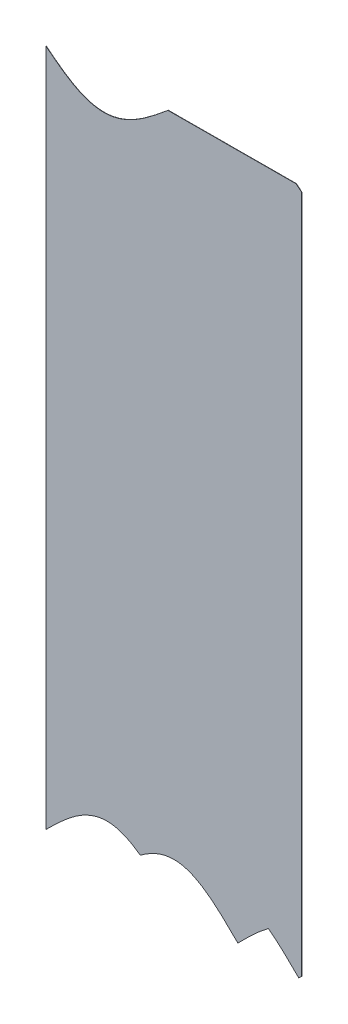
ISO-10303-21;
HEADER;
FILE_DESCRIPTION(('STEP AP214'),'2;1');
FILE_NAME('part.step','',(''),(''),'','','');
FILE_SCHEMA(('AUTOMOTIVE_DESIGN { 1 0 10303 214 1 1 1 1 }'));
ENDSEC;
DATA;
#1=APPLICATION_CONTEXT('core data for automotive mechanical design processes');
#2=APPLICATION_PROTOCOL_DEFINITION('international standard','automotive_design',2000,#1);
#3=PRODUCT_CONTEXT('',#1,'mechanical');
#4=PRODUCT('Part','Part','',(#3));
#5=PRODUCT_RELATED_PRODUCT_CATEGORY('part','',(#4));
#6=PRODUCT_DEFINITION_FORMATION('','',#4);
#7=PRODUCT_DEFINITION_CONTEXT('part definition',#1,'design');
#8=PRODUCT_DEFINITION('design','',#6,#7);
#9=PRODUCT_DEFINITION_SHAPE('','',#8);
#10=(LENGTH_UNIT() NAMED_UNIT(*) SI_UNIT(.MILLI.,.METRE.));
#11=(NAMED_UNIT(*) PLANE_ANGLE_UNIT() SI_UNIT($,.RADIAN.));
#12=(NAMED_UNIT(*) SI_UNIT($,.STERADIAN.) SOLID_ANGLE_UNIT());
#13=UNCERTAINTY_MEASURE_WITH_UNIT(LENGTH_MEASURE(1.E-05),#10,'distance_accuracy_value','');
#14=(GEOMETRIC_REPRESENTATION_CONTEXT(3) GLOBAL_UNCERTAINTY_ASSIGNED_CONTEXT((#13)) GLOBAL_UNIT_ASSIGNED_CONTEXT((#10,
#11,#12)) REPRESENTATION_CONTEXT('',''));
#15=CARTESIAN_POINT('',(0.,0.,0.));
#16=DIRECTION('',(0.,0.,1.));
#17=DIRECTION('',(1.,0.,0.));
#18=AXIS2_PLACEMENT_3D('',#15,#16,#17);
#19=CARTESIAN_POINT('',(-322.330788957895,481.431997369776,168.147839988997));
#20=DIRECTION('',(-0.757872648002997,0.652395697796506,0.00298377370707072));
#21=DIRECTION('',(-0.652398601924532,-0.75787602165982,0.));
#22=AXIS2_PLACEMENT_3D('',#19,#20,#21);
#23=PLANE('',#22);
#24=CARTESIAN_POINT('',(-322.330395257108,481.431997369776,168.247839213992));
#25=CARTESIAN_POINT('',(-322.334377498887,481.427371222006,168.247854892231));
#26=B_SPLINE_CURVE_WITH_KNOTS('',1,(#24,#25),.UNSPECIFIED.,.F.,.F.,(2,2),(0.,1.),.UNSPECIFIED.);
#27=CARTESIAN_POINT('',(-322.330395583371,481.431996990757,168.247839215277));
#28=VERTEX_POINT('',#27);
#29=CARTESIAN_POINT('',(-322.334377620597,481.427371847329,168.24785489271));
#30=VERTEX_POINT('',#29);
#31=EDGE_CURVE('E197',#28,#30,#26,.T.);
#32=ORIENTED_EDGE('',*,*,#31,.F.);
#33=DIRECTION('',(0.00393700787401531,0.,0.999992249954468));
#34=VECTOR('',#33,1.);
#35=CARTESIAN_POINT('',(-322.330789284159,481.431996990757,168.147839990281));
#36=LINE('',#35,#34);
#37=CARTESIAN_POINT('',(-322.330789284159,481.431996990757,168.147839990281));
#38=VERTEX_POINT('',#37);
#39=EDGE_CURVE('E13',#38,#28,#36,.T.);
#40=ORIENTED_EDGE('',*,*,#39,.F.);
#41=CARTESIAN_POINT('',(-322.330788957895,481.431997369776,168.147839988997));
#42=CARTESIAN_POINT('',(-322.334771199674,481.427371222006,168.147855667235));
#43=B_SPLINE_CURVE_WITH_KNOTS('',1,(#41,#42),.UNSPECIFIED.,.F.,.F.,(2,2),(0.,1.),.UNSPECIFIED.);
#44=CARTESIAN_POINT('',(-322.334771321385,481.427371847329,168.147855667715));
#45=VERTEX_POINT('',#44);
#46=EDGE_CURVE('E285',#38,#45,#43,.T.);
#47=ORIENTED_EDGE('',*,*,#46,.T.);
#48=DIRECTION('',(0.00393700787401531,0.,0.999992249954468));
#49=VECTOR('',#48,1.);
#50=CARTESIAN_POINT('',(-322.334771321385,481.427371847329,168.147855667715));
#51=LINE('',#50,#49);
#52=EDGE_CURVE('E132',#45,#30,#51,.T.);
#53=ORIENTED_EDGE('',*,*,#52,.T.);
#54=EDGE_LOOP('',(#32,#40,#47,#53));
#55=FACE_BOUND('',#54,.T.);
#56=ADVANCED_FACE('F64',(#55),#23,.T.);
#57=CARTESIAN_POINT('',(-320.56832134094,479.98219318182,168.140901086334));
#58=CARTESIAN_POINT('',(-320.960198959357,480.302507821558,168.142443923561));
#59=CARTESIAN_POINT('',(-321.890590486305,481.068483708455,168.146106910717));
#60=CARTESIAN_POINT('',(-322.330788957895,481.431997369776,168.147839988997));
#61=B_SPLINE_CURVE_WITH_KNOTS('',2,(#57,#58,#59,#60),.UNSPECIFIED.,.F.,.F.,(3,1,3),(0.,0.5,1.),.UNSPECIFIED.);
#62=DIRECTION('',(0.00393700787401531,0.,0.999992249954468));
#63=VECTOR('',#62,1.);
#64=SURFACE_OF_LINEAR_EXTRUSION('',#61,#63);
#65=CARTESIAN_POINT('',(-320.567927640152,479.98219318182,168.24090031133));
#66=CARTESIAN_POINT('',(-320.95980525857,480.302507821558,168.242443148556));
#67=CARTESIAN_POINT('',(-321.890196785517,481.068483708455,168.246106135712));
#68=CARTESIAN_POINT('',(-322.330395257108,481.431997369776,168.247839213992));
#69=B_SPLINE_CURVE_WITH_KNOTS('',2,(#65,#66,#67,#68),.UNSPECIFIED.,.F.,.F.,(3,1,3),(0.,0.5,1.),.UNSPECIFIED.);
#70=CARTESIAN_POINT('',(-320.567927640152,479.98219318182,168.24090031133));
#71=VERTEX_POINT('',#70);
#72=EDGE_CURVE('E205',#71,#28,#69,.T.);
#73=ORIENTED_EDGE('',*,*,#72,.F.);
#74=DIRECTION('',(0.00393700787401531,0.,0.999992249954468));
#75=VECTOR('',#74,1.);
#76=CARTESIAN_POINT('',(-320.56832134094,479.98219318182,168.140901086334));
#77=LINE('',#76,#75);
#78=CARTESIAN_POINT('',(-320.56832134094,479.98219318182,168.140901086334));
#79=VERTEX_POINT('',#78);
#80=EDGE_CURVE('E72',#79,#71,#77,.T.);
#81=ORIENTED_EDGE('',*,*,#80,.F.);
#82=EDGE_CURVE('E369',#79,#38,#61,.T.);
#83=ORIENTED_EDGE('',*,*,#82,.T.);
#84=ORIENTED_EDGE('',*,*,#39,.T.);
#85=EDGE_LOOP('',(#73,#81,#83,#84));
#86=FACE_BOUND('',#85,.T.);
#87=ADVANCED_FACE('F322',(#86),#64,.T.);
#88=CARTESIAN_POINT('',(-320.56832134094,268.328764497974,168.140901086334));
#89=DIRECTION('',(0.999992249954468,0.,-0.00393700787401531));
#90=DIRECTION('',(-0.00393700787401531,0.,-0.999992249954468));
#91=AXIS2_PLACEMENT_3D('',#88,#89,#90);
#92=PLANE('',#91);
#93=DIRECTION('',(0.,1.,0.));
#94=VECTOR('',#93,1.);
#95=CARTESIAN_POINT('',(-320.567927640152,268.328764497974,168.24090031133));
#96=LINE('',#95,#94);
#97=CARTESIAN_POINT('',(-320.567927640152,268.328764497975,168.24090031133));
#98=VERTEX_POINT('',#97);
#99=EDGE_CURVE('E213',#98,#71,#96,.T.);
#100=ORIENTED_EDGE('',*,*,#99,.F.);
#101=DIRECTION('',(0.00393700787401531,0.,0.999992249954468));
#102=VECTOR('',#101,1.);
#103=CARTESIAN_POINT('',(-320.56832134094,268.328764497975,168.140901086334));
#104=LINE('',#103,#102);
#105=CARTESIAN_POINT('',(-320.56832134094,268.328764497975,168.140901086334));
#106=VERTEX_POINT('',#105);
#107=EDGE_CURVE('E311',#106,#98,#104,.T.);
#108=ORIENTED_EDGE('',*,*,#107,.F.);
#109=DIRECTION('',(0.,1.,0.));
#110=VECTOR('',#109,1.);
#111=CARTESIAN_POINT('',(-320.56832134094,268.328764497974,168.140901086334));
#112=LINE('',#111,#110);
#113=EDGE_CURVE('E318',#106,#79,#112,.T.);
#114=ORIENTED_EDGE('',*,*,#113,.T.);
#115=ORIENTED_EDGE('',*,*,#80,.T.);
#116=EDGE_LOOP('',(#100,#108,#114,#115));
#117=FACE_BOUND('',#116,.T.);
#118=ADVANCED_FACE('F316',(#117),#92,.T.);
#119=CARTESIAN_POINT('',(-320.56832134094,268.328764497975,168.140901086334));
#120=CARTESIAN_POINT('',(-320.757077697651,268.139733582945,168.141644227356));
#121=CARTESIAN_POINT('',(-321.002892084208,267.893118426474,168.142612008032));
#122=CARTESIAN_POINT('',(-321.022755719495,267.873188574578,168.142690211927));
#123=CARTESIAN_POINT('',(-321.179185315276,267.716228172024,168.14330608125));
#124=CARTESIAN_POINT('',(-321.462292284474,267.432000000001,168.144420684255));
#125=B_SPLINE_CURVE_WITH_KNOTS('',2,(#119,#120,#121,#122,#123,#124),.UNSPECIFIED.,.F.,.F.,(3,1,
1,1,3),(0.,0.475,0.5,0.525,1.),.UNSPECIFIED.);
#126=DIRECTION('',(0.00393700787401531,0.,0.999992249954468));
#127=VECTOR('',#126,1.);
#128=SURFACE_OF_LINEAR_EXTRUSION('',#125,#127);
#129=CARTESIAN_POINT('',(-320.567927640152,268.328764497975,168.24090031133));
#130=CARTESIAN_POINT('',(-320.756683996863,268.139733582945,168.241643452352));
#131=CARTESIAN_POINT('',(-321.002498383421,267.893118426474,168.242611233028));
#132=CARTESIAN_POINT('',(-321.022362018708,267.873188574578,168.242689436922));
#133=CARTESIAN_POINT('',(-321.178791614489,267.716228172024,168.243305306245));
#134=CARTESIAN_POINT('',(-321.461898583686,267.432000000001,168.244419909251));
#135=B_SPLINE_CURVE_WITH_KNOTS('',2,(#129,#130,#131,#132,#133,#134),.UNSPECIFIED.,.F.,.F.,(3,1,
1,1,3),(0.,0.475,0.5,0.525,1.),.UNSPECIFIED.);
#136=CARTESIAN_POINT('',(-321.461898230831,267.432000354254,168.244419907861));
#137=VERTEX_POINT('',#136);
#138=EDGE_CURVE('E219',#98,#137,#135,.T.);
#139=ORIENTED_EDGE('',*,*,#138,.T.);
#140=DIRECTION('',(0.00393700787401531,0.,0.999992249954468));
#141=VECTOR('',#140,1.);
#142=CARTESIAN_POINT('',(-321.462291931618,267.432000354254,168.144420682866));
#143=LINE('',#142,#141);
#144=CARTESIAN_POINT('',(-321.462291931618,267.432000354254,168.144420682866));
#145=VERTEX_POINT('',#144);
#146=EDGE_CURVE('E308',#145,#137,#143,.T.);
#147=ORIENTED_EDGE('',*,*,#146,.F.);
#148=EDGE_CURVE('E339',#106,#145,#125,.T.);
#149=ORIENTED_EDGE('',*,*,#148,.F.);
#150=ORIENTED_EDGE('',*,*,#107,.T.);
#151=EDGE_LOOP('',(#139,#147,#149,#150));
#152=FACE_BOUND('',#151,.T.);
#153=ADVANCED_FACE('F330',(#152),#128,.F.);
#154=CARTESIAN_POINT('',(-321.462292284474,267.432000000001,168.144420684255));
#155=CARTESIAN_POINT('',(-321.856559645749,267.827828797905,168.145972929991));
#156=CARTESIAN_POINT('',(-322.053749962608,268.025583728596,168.146749275838));
#157=CARTESIAN_POINT('',(-322.382250878624,268.355025239281,168.148042596554));
#158=CARTESIAN_POINT('',(-322.960527736483,268.933055903792,168.150319294741));
#159=CARTESIAN_POINT('',(-323.546316052846,269.515388330365,168.152625565829));
#160=CARTESIAN_POINT('',(-324.134607955361,270.095711116484,168.154941693632));
#161=CARTESIAN_POINT('',(-324.72403774647,270.67137834553,168.157262301345));
#162=CARTESIAN_POINT('',(-325.314080163924,271.240600306046,168.159585320992));
#163=CARTESIAN_POINT('',(-325.904490023213,271.801883833022,168.161909787272));
#164=CARTESIAN_POINT('',(-326.805976568551,272.644362399339,168.165458974406));
#165=CARTESIAN_POINT('',(-327.98460798061,273.700660867898,168.170099291518));
#166=CARTESIAN_POINT('',(-329.164459067439,274.703581992053,168.174744410537));
#167=CARTESIAN_POINT('',(-330.345019926099,275.643834369482,168.179392323955));
#168=CARTESIAN_POINT('',(-330.925615134616,276.071090350348,168.181678149578));
#169=B_SPLINE_CURVE_WITH_KNOTS('',2,(#154,#155,#156,#157,#158,#159,#160,#161,#162,#163,#164,
#165,#166,#167,#168),.UNSPECIFIED.,.F.,.F.,(3,2,1,1,1,1,1,1,1,1,1,1,3),(0.,0.0625,0.125,0.1875,
0.25,0.3125,0.375,0.4375,0.5,0.625,0.75,0.875,1.),.UNSPECIFIED.);
#170=DIRECTION('',(0.00393700787401531,0.,0.999992249954468));
#171=VECTOR('',#170,1.);
#172=SURFACE_OF_LINEAR_EXTRUSION('',#169,#171);
#173=CARTESIAN_POINT('',(-321.461898583686,267.432000000001,168.244419909251));
#174=CARTESIAN_POINT('',(-321.856165944962,267.827828797905,168.245972154986));
#175=CARTESIAN_POINT('',(-322.053356261821,268.025583728596,168.246748500833));
#176=CARTESIAN_POINT('',(-322.381857177836,268.355025239281,168.24804182155));
#177=CARTESIAN_POINT('',(-322.960134035696,268.933055903792,168.250318519737));
#178=CARTESIAN_POINT('',(-323.545922352059,269.515388330365,168.252624790825));
#179=CARTESIAN_POINT('',(-324.134214254573,270.095711116484,168.254940918627));
#180=CARTESIAN_POINT('',(-324.723644045682,270.67137834553,168.257261526341));
#181=CARTESIAN_POINT('',(-325.313686463137,271.240600306046,168.259584545988));
#182=CARTESIAN_POINT('',(-325.904096322425,271.801883833022,168.261909012267));
#183=CARTESIAN_POINT('',(-326.805582867764,272.644362399339,168.265458199401));
#184=CARTESIAN_POINT('',(-327.984214279823,273.700660867898,168.270098516513));
#185=CARTESIAN_POINT('',(-329.164065366652,274.703581992053,168.274743635532));
#186=CARTESIAN_POINT('',(-330.344626225312,275.643834369482,168.27939154895));
#187=CARTESIAN_POINT('',(-330.925221433828,276.071090350348,168.281677374573));
#188=B_SPLINE_CURVE_WITH_KNOTS('',2,(#173,#174,#175,#176,#177,#178,#179,#180,#181,#182,#183,
#184,#185,#186,#187),.UNSPECIFIED.,.F.,.F.,(3,2,1,1,1,1,1,1,1,1,1,1,3),(0.,0.0625,0.125,0.1875,
0.25,0.3125,0.375,0.4375,0.5,0.625,0.75,0.875,1.),.UNSPECIFIED.);
#189=CARTESIAN_POINT('',(-330.925221012033,276.071090039952,168.281677372912));
#190=VERTEX_POINT('',#189);
#191=EDGE_CURVE('E223',#137,#190,#188,.T.);
#192=ORIENTED_EDGE('',*,*,#191,.T.);
#193=DIRECTION('',(0.00393700787401531,0.,0.999992249954468));
#194=VECTOR('',#193,1.);
#195=CARTESIAN_POINT('',(-330.925614712821,276.071090039952,168.181678147917));
#196=LINE('',#195,#194);
#197=CARTESIAN_POINT('',(-330.925614712821,276.071090039952,168.181678147917));
#198=VERTEX_POINT('',#197);
#199=EDGE_CURVE('E305',#198,#190,#196,.T.);
#200=ORIENTED_EDGE('',*,*,#199,.F.);
#201=EDGE_CURVE('E336',#145,#198,#169,.T.);
#202=ORIENTED_EDGE('',*,*,#201,.F.);
#203=ORIENTED_EDGE('',*,*,#146,.T.);
#204=EDGE_LOOP('',(#192,#200,#202,#203));
#205=FACE_BOUND('',#204,.T.);
#206=ADVANCED_FACE('F334',(#205),#172,.F.);
#207=CARTESIAN_POINT('',(-330.925615134616,276.071090350348,168.181678149578));
#208=CARTESIAN_POINT('',(-331.506176417281,275.643859335281,168.183963841633));
#209=CARTESIAN_POINT('',(-332.686700785038,274.703640046976,168.188611611385));
#210=CARTESIAN_POINT('',(-333.866551930113,273.700722389315,168.193256730633));
#211=CARTESIAN_POINT('',(-335.045183436303,272.644426811852,168.197897048116));
#212=CARTESIAN_POINT('',(-335.946669796317,271.801950263575,168.20144623452));
#213=CARTESIAN_POINT('',(-336.537079697635,271.240667759343,168.203770700965));
#214=CARTESIAN_POINT('',(-337.127122179268,270.671446651715,168.206093720865));
#215=CARTESIAN_POINT('',(-337.716552064583,270.095780094944,168.208414328949));
#216=CARTESIAN_POINT('',(-338.304844141954,269.515457748929,168.21073045744));
#217=CARTESIAN_POINT('',(-338.890632893447,268.933125348367,168.213036730241));
#218=CARTESIAN_POINT('',(-339.468911403546,268.355093334999,168.215313434933));
#219=CARTESIAN_POINT('',(-339.797480306624,268.025583728596,168.216607023317));
#220=CARTESIAN_POINT('',(-339.994623638438,267.827875969089,168.217383184182));
#221=CARTESIAN_POINT('',(-340.388937984758,267.432000000001,168.2189356149));
#222=B_SPLINE_CURVE_WITH_KNOTS('',2,(#207,#208,#209,#210,#211,#212,#213,#214,#215,#216,#217,
#218,#219,#220,#221),.UNSPECIFIED.,.F.,.F.,(3,1,1,1,1,1,1,1,1,1,1,2,3),(0.,0.125,0.25,0.375,0.5,
0.5625,0.625,0.6875,0.75,0.8125,0.875,0.9375,1.),.UNSPECIFIED.);
#223=DIRECTION('',(0.00393700787401531,0.,0.999992249954468));
#224=VECTOR('',#223,1.);
#225=SURFACE_OF_LINEAR_EXTRUSION('',#222,#224);
#226=CARTESIAN_POINT('',(-330.925221433828,276.071090350348,168.281677374573));
#227=CARTESIAN_POINT('',(-331.505782716493,275.643859335281,168.283963066628));
#228=CARTESIAN_POINT('',(-332.68630708425,274.703640046976,168.28861083638));
#229=CARTESIAN_POINT('',(-333.866158229326,273.700722389315,168.293255955628));
#230=CARTESIAN_POINT('',(-335.044789735516,272.644426811852,168.297896273112));
#231=CARTESIAN_POINT('',(-335.946276095529,271.801950263575,168.301445459516));
#232=CARTESIAN_POINT('',(-336.536685996848,271.240667759343,168.303769925961));
#233=CARTESIAN_POINT('',(-337.12672847848,270.671446651715,168.30609294586));
#234=CARTESIAN_POINT('',(-337.716158363795,270.095780094944,168.308413553945));
#235=CARTESIAN_POINT('',(-338.304450441167,269.515457748929,168.310729682436));
#236=CARTESIAN_POINT('',(-338.89023919266,268.933125348367,168.313035955237));
#237=CARTESIAN_POINT('',(-339.468517702759,268.355093334999,168.315312659929));
#238=CARTESIAN_POINT('',(-339.797086605837,268.025583728596,168.316606248313));
#239=CARTESIAN_POINT('',(-339.994229937651,267.827875969089,168.317382409178));
#240=CARTESIAN_POINT('',(-340.38854428397,267.432000000001,168.318934839895));
#241=B_SPLINE_CURVE_WITH_KNOTS('',2,(#226,#227,#228,#229,#230,#231,#232,#233,#234,#235,#236,
#237,#238,#239,#240),.UNSPECIFIED.,.F.,.F.,(3,1,1,1,1,1,1,1,1,1,1,2,3),(0.,0.125,0.25,0.375,0.5,
0.5625,0.625,0.6875,0.75,0.8125,0.875,0.9375,1.),.UNSPECIFIED.);
#242=CARTESIAN_POINT('',(-340.388543931114,267.432000354254,168.318934838506));
#243=VERTEX_POINT('',#242);
#244=EDGE_CURVE('E230',#190,#243,#241,.T.);
#245=ORIENTED_EDGE('',*,*,#244,.T.);
#246=DIRECTION('',(0.00393700787401531,0.,0.999992249954468));
#247=VECTOR('',#246,1.);
#248=CARTESIAN_POINT('',(-340.388937631902,267.432000354254,168.218935613511));
#249=LINE('',#248,#247);
#250=CARTESIAN_POINT('',(-340.388937631902,267.432000354254,168.218935613511));
#251=VERTEX_POINT('',#250);
#252=EDGE_CURVE('E302',#251,#243,#249,.T.);
#253=ORIENTED_EDGE('',*,*,#252,.F.);
#254=EDGE_CURVE('E338',#198,#251,#222,.T.);
#255=ORIENTED_EDGE('',*,*,#254,.F.);
#256=ORIENTED_EDGE('',*,*,#199,.T.);
#257=EDGE_LOOP('',(#245,#253,#255,#256));
#258=FACE_BOUND('',#257,.T.);
#259=ADVANCED_FACE('F362',(#258),#225,.F.);
#260=CARTESIAN_POINT('',(-340.388937984758,267.432000000001,168.2189356149));
#261=CARTESIAN_POINT('',(-340.704297832972,267.748608783548,168.220177198728));
#262=CARTESIAN_POINT('',(-340.862024175728,267.906849069204,168.220798173394));
#263=CARTESIAN_POINT('',(-341.124788873571,268.170469971843,168.221832688096));
#264=CARTESIAN_POINT('',(-341.587342588013,268.633557245671,168.223653779825));
#265=CARTESIAN_POINT('',(-342.055904403843,269.101017228589,168.225498525681));
#266=CARTESIAN_POINT('',(-342.78550764524,269.825329577419,168.228371001649));
#267=CARTESIAN_POINT('',(-343.722519235765,270.74246865894,168.232060052249));
#268=CARTESIAN_POINT('',(-344.6635351191,271.645243159154,168.235764867904));
#269=CARTESIAN_POINT('',(-345.606370128187,272.526385528975,168.239476845526));
#270=CARTESIAN_POINT('',(-346.550183558413,273.380108286688,168.243192675231));
#271=CARTESIAN_POINT('',(-347.494582875178,274.201232462322,168.246910811593));
#272=CARTESIAN_POINT('',(-348.439360058703,274.984949854647,168.250630435631));
#273=CARTESIAN_POINT('',(-349.384394484902,275.726751330112,168.254351072443));
#274=CARTESIAN_POINT('',(-350.329611226209,276.422409555424,168.258072427037));
#275=CARTESIAN_POINT('',(-351.274961206061,277.067982323384,168.261794306196));
#276=CARTESIAN_POINT('',(-352.220410846477,277.659823943802,168.265516577722));
#277=CARTESIAN_POINT('',(-353.165936239217,278.19459965208,168.269239147489));
#278=CARTESIAN_POINT('',(-354.111519825465,278.669300800495,168.272961946365));
#279=CARTESIAN_POINT('',(-355.057148283643,279.081259515709,168.276684921904));
#280=CARTESIAN_POINT('',(-356.002811185809,279.428162251105,168.28040803305));
#281=CARTESIAN_POINT('',(-356.948500128554,279.708061844443,168.284131246719));
#282=CARTESIAN_POINT('',(-357.894208104061,279.919387809357,168.287854535321));
#283=CARTESIAN_POINT('',(-358.839929067906,280.060954732553,168.291577875059));
#284=CARTESIAN_POINT('',(-359.785657599605,280.131968642999,168.295301244591));
#285=CARTESIAN_POINT('',(-360.731388615642,280.132031301646,168.299024623904));
#286=CARTESIAN_POINT('',(-361.677117153637,280.061142357328,168.302747993461));
#287=CARTESIAN_POINT('',(-362.622838139388,279.919699347624,168.306471333285));
#288=CARTESIAN_POINT('',(-363.568546147946,279.708495547372,168.310194622016));
#289=CARTESIAN_POINT('',(-364.514235132811,279.428715686129,168.313917835851));
#290=CARTESIAN_POINT('',(-365.459898083884,279.081929578747,168.31764094719));
#291=CARTESIAN_POINT('',(-366.405526610589,278.670083729619,168.321363922999));
#292=CARTESIAN_POINT('',(-367.351110294364,278.195491043832,168.325086722259));
#293=CARTESIAN_POINT('',(-368.296635798562,277.660818792983,168.328809292465));
#294=CARTESIAN_POINT('',(-369.242085582141,277.069075032847,168.332531564555));
#295=CARTESIAN_POINT('',(-370.187418584275,276.423605687197,168.336253376872));
#296=CARTESIAN_POINT('',(-370.666454206828,276.071090350347,168.338139358506));
#297=B_SPLINE_CURVE_WITH_KNOTS('',2,(#260,#261,#262,#263,#264,#265,#266,#267,#268,#269,#270,
#271,#272,#273,#274,#275,#276,#277,#278,#279,#280,#281,#282,#283,#284,#285,#286,#287,#288,#289,
#290,#291,#292,#293,#294,#295,#296),.UNSPECIFIED.,.F.,.F.,(3,2,1,1,1,1,1,1,1,1,1,1,1,1,1,1,1,1,
1,1,1,1,1,1,1,1,1,1,1,1,1,1,1,1,3),(0.,0.015625,0.03125,0.046875,0.0625,0.09375,0.125,0.15625,
0.1875,0.21875,0.25,0.28125,0.3125,0.34375,0.375,0.40625,0.4375,0.46875,0.5,0.53125,0.5625,
0.59375,0.625,0.65625,0.6875,0.71875,0.75,0.78125,0.8125,0.84375,0.875,0.90625,0.9375,0.96875,
1.),.UNSPECIFIED.);
#298=DIRECTION('',(0.00393700787401531,0.,0.999992249954468));
#299=VECTOR('',#298,1.);
#300=SURFACE_OF_LINEAR_EXTRUSION('',#297,#299);
#301=CARTESIAN_POINT('',(-340.38854428397,267.432000000001,168.318934839895));
#302=CARTESIAN_POINT('',(-340.703904132185,267.748608783548,168.320176423723));
#303=CARTESIAN_POINT('',(-340.86163047494,267.906849069204,168.320797398389));
#304=CARTESIAN_POINT('',(-341.124395172783,268.170469971843,168.321831913091));
#305=CARTESIAN_POINT('',(-341.586948887226,268.633557245671,168.323653004821));
#306=CARTESIAN_POINT('',(-342.055510703056,269.101017228589,168.325497750676));
#307=CARTESIAN_POINT('',(-342.785113944452,269.825329577419,168.328370226644));
#308=CARTESIAN_POINT('',(-343.722125534978,270.74246865894,168.332059277244));
#309=CARTESIAN_POINT('',(-344.663141418312,271.645243159154,168.335764092899));
#310=CARTESIAN_POINT('',(-345.6059764274,272.526385528975,168.339476070522));
#311=CARTESIAN_POINT('',(-346.549789857626,273.380108286688,168.343191900226));
#312=CARTESIAN_POINT('',(-347.49418917439,274.201232462322,168.346910036588));
#313=CARTESIAN_POINT('',(-348.438966357916,274.984949854647,168.350629660626));
#314=CARTESIAN_POINT('',(-349.384000784114,275.726751330112,168.354350297438));
#315=CARTESIAN_POINT('',(-350.329217525422,276.422409555424,168.358071652032));
#316=CARTESIAN_POINT('',(-351.274567505274,277.067982323384,168.361793531191));
#317=CARTESIAN_POINT('',(-352.220017145689,277.659823943802,168.365515802718));
#318=CARTESIAN_POINT('',(-353.16554253843,278.19459965208,168.369238372484));
#319=CARTESIAN_POINT('',(-354.111126124678,278.669300800495,168.372961171361));
#320=CARTESIAN_POINT('',(-355.056754582855,279.081259515709,168.3766841469));
#321=CARTESIAN_POINT('',(-356.002417485021,279.428162251105,168.380407258046));
#322=CARTESIAN_POINT('',(-356.948106427767,279.708061844443,168.384130471715));
#323=CARTESIAN_POINT('',(-357.893814403273,279.919387809357,168.387853760317));
#324=CARTESIAN_POINT('',(-358.839535367119,280.060954732553,168.391577100054));
#325=CARTESIAN_POINT('',(-359.785263898818,280.131968642999,168.395300469586));
#326=CARTESIAN_POINT('',(-360.730994914854,280.132031301646,168.399023848899));
#327=CARTESIAN_POINT('',(-361.67672345285,280.061142357328,168.402747218456));
#328=CARTESIAN_POINT('',(-362.622444438601,279.919699347624,168.40647055828));
#329=CARTESIAN_POINT('',(-363.568152447158,279.708495547372,168.410193847012));
#330=CARTESIAN_POINT('',(-364.513841432023,279.428715686129,168.413917060847));
#331=CARTESIAN_POINT('',(-365.459504383097,279.081929578747,168.417640172186));
#332=CARTESIAN_POINT('',(-366.405132909801,278.670083729619,168.421363147994));
#333=CARTESIAN_POINT('',(-367.350716593576,278.195491043832,168.425085947255));
#334=CARTESIAN_POINT('',(-368.296242097775,277.660818792983,168.42880851746));
#335=CARTESIAN_POINT('',(-369.241691881353,277.069075032847,168.43253078955));
#336=CARTESIAN_POINT('',(-370.187024883487,276.423605687197,168.436252601867));
#337=CARTESIAN_POINT('',(-370.66606050604,276.071090350347,168.438138583502));
#338=B_SPLINE_CURVE_WITH_KNOTS('',2,(#301,#302,#303,#304,#305,#306,#307,#308,#309,#310,#311,
#312,#313,#314,#315,#316,#317,#318,#319,#320,#321,#322,#323,#324,#325,#326,#327,#328,#329,#330,
#331,#332,#333,#334,#335,#336,#337),.UNSPECIFIED.,.F.,.F.,(3,2,1,1,1,1,1,1,1,1,1,1,1,1,1,1,1,1,
1,1,1,1,1,1,1,1,1,1,1,1,1,1,1,1,3),(0.,0.015625,0.03125,0.046875,0.0625,0.09375,0.125,0.15625,
0.1875,0.21875,0.25,0.28125,0.3125,0.34375,0.375,0.40625,0.4375,0.46875,0.5,0.53125,0.5625,
0.59375,0.625,0.65625,0.6875,0.71875,0.75,0.78125,0.8125,0.84375,0.875,0.90625,0.9375,0.96875,
1.),.UNSPECIFIED.);
#339=CARTESIAN_POINT('',(-370.666060084242,276.071090660742,168.438138581841));
#340=VERTEX_POINT('',#339);
#341=EDGE_CURVE('E237',#243,#340,#338,.T.);
#342=ORIENTED_EDGE('',*,*,#341,.T.);
#343=DIRECTION('',(0.00393700787401531,0.,0.999992249954468));
#344=VECTOR('',#343,1.);
#345=CARTESIAN_POINT('',(-370.66645378503,276.071090660742,168.338139356846));
#346=LINE('',#345,#344);
#347=CARTESIAN_POINT('',(-370.66645378503,276.071090660742,168.338139356846));
#348=VERTEX_POINT('',#347);
#349=EDGE_CURVE('E299',#348,#340,#346,.T.);
#350=ORIENTED_EDGE('',*,*,#349,.F.);
#351=EDGE_CURVE('E341',#251,#348,#297,.T.);
#352=ORIENTED_EDGE('',*,*,#351,.F.);
#353=ORIENTED_EDGE('',*,*,#252,.T.);
#354=EDGE_LOOP('',(#342,#350,#352,#353));
#355=FACE_BOUND('',#354,.T.);
#356=ADVANCED_FACE('F406',(#355),#300,.F.);
#357=CARTESIAN_POINT('',(-370.666454206828,276.071090350347,168.338139358506));
#358=CARTESIAN_POINT('',(-371.129561941891,276.411884586804,168.339962631436));
#359=CARTESIAN_POINT('',(-372.043886232976,277.037834969649,168.343562361268));
#360=CARTESIAN_POINT('',(-372.958350462174,277.613706279491,168.347162642041));
#361=CARTESIAN_POINT('',(-373.872882391955,278.136428954093,168.350763189354));
#362=CARTESIAN_POINT('',(-374.787466749569,278.603252691807,168.354363943077));
#363=CARTESIAN_POINT('',(-375.702091883396,279.011723721842,168.357964857338));
#364=CARTESIAN_POINT('',(-376.616748632295,279.359696494126,168.361565896069));
#365=CARTESIAN_POINT('',(-377.53142959201,279.645344160638,168.365167030118));
#366=CARTESIAN_POINT('',(-378.446128610359,279.867167631212,168.368768235265));
#367=CARTESIAN_POINT('',(-379.360840398394,280.024003068538,168.372369490687));
#368=CARTESIAN_POINT('',(-380.275560231323,280.115027749804,168.375970777782));
#369=CARTESIAN_POINT('',(-381.190283737134,280.139764233728,168.379572079337));
#370=CARTESIAN_POINT('',(-382.105006713335,280.098082779337,168.383173378807));
#371=CARTESIAN_POINT('',(-383.019724918322,279.990202003792,168.386774659493));
#372=CARTESIAN_POINT('',(-383.934433915215,279.816687775604,168.390375903926));
#373=CARTESIAN_POINT('',(-384.849128862997,279.578450341895,168.393977093047));
#374=CARTESIAN_POINT('',(-385.763804266927,279.276739735541,168.397578205223));
#375=CARTESIAN_POINT('',(-386.6784537017,278.913139476503,168.401179215158));
#376=CARTESIAN_POINT('',(-387.59306938089,278.489558670829,168.404780092196));
#377=CARTESIAN_POINT('',(-388.507641589202,278.00822258343,168.408380798087));
#378=CARTESIAN_POINT('',(-389.42215787115,277.471661825519,168.411981283794));
#379=CARTESIAN_POINT('',(-390.336601780019,276.882700393442,168.415581484565));
#380=CARTESIAN_POINT('',(-391.250950945471,276.244442892535,168.419181312328));
#381=CARTESIAN_POINT('',(-392.165173923965,275.560261543025,168.422780643288));
#382=CARTESIAN_POINT('',(-393.079224945869,274.833783971913,168.426379297248));
#383=CARTESIAN_POINT('',(-393.993034376951,274.068884008509,168.429977000056));
#384=CARTESIAN_POINT('',(-394.90649051121,273.269680036549,168.433573311921));
#385=CARTESIAN_POINT('',(-395.819402011464,272.440551718686,168.43716747954));
#386=CARTESIAN_POINT('',(-396.73141097789,271.586205287922,168.44075809385));
#387=CARTESIAN_POINT('',(-397.641760579793,270.71188392867,168.444342175177));
#388=CARTESIAN_POINT('',(-398.548523742505,269.824118179228,168.447912136556));
#389=CARTESIAN_POINT('',(-399.253691623123,269.124201585034,168.450688409571));
#390=CARTESIAN_POINT('',(-399.707348986316,268.671741241076,168.452474476024));
#391=CARTESIAN_POINT('',(-399.950393700787,268.428486315291,168.453431352394));
#392=B_SPLINE_CURVE_WITH_KNOTS('',2,(#357,#358,#359,#360,#361,#362,#363,#364,#365,#366,#367,
#368,#369,#370,#371,#372,#373,#374,#375,#376,#377,#378,#379,#380,#381,#382,#383,#384,#385,#386,
#387,#388,#389,#390,#391),.UNSPECIFIED.,.F.,.F.,(3,1,1,1,1,1,1,1,1,1,1,1,1,1,1,1,1,1,1,1,1,1,1,
1,1,1,1,1,1,1,1,1,1,3),(0.,0.03125,0.0625,0.09375,0.125,0.15625,0.1875,0.21875,0.25,0.28125,
0.3125,0.34375,0.375,0.40625,0.4375,0.46875,0.5,0.53125,0.5625,0.59375,0.625,0.65625,0.6875,
0.71875,0.75,0.78125,0.8125,0.84375,0.875,0.90625,0.9375,0.96875,0.984375,1.),.UNSPECIFIED.);
#393=DIRECTION('',(0.00393700787401531,0.,0.999992249954468));
#394=VECTOR('',#393,1.);
#395=SURFACE_OF_LINEAR_EXTRUSION('',#392,#394);
#396=CARTESIAN_POINT('',(-370.66606050604,276.071090350347,168.438138583502));
#397=CARTESIAN_POINT('',(-371.129168241104,276.411884586804,168.439961856432));
#398=CARTESIAN_POINT('',(-372.043492532189,277.037834969649,168.443561586263));
#399=CARTESIAN_POINT('',(-372.957956761386,277.613706279491,168.447161867036));
#400=CARTESIAN_POINT('',(-373.872488691168,278.136428954093,168.450762414349));
#401=CARTESIAN_POINT('',(-374.787073048782,278.603252691807,168.454363168073));
#402=CARTESIAN_POINT('',(-375.701698182608,279.011723721842,168.457964082334));
#403=CARTESIAN_POINT('',(-376.616354931508,279.359696494126,168.461565121064));
#404=CARTESIAN_POINT('',(-377.531035891222,279.645344160638,168.465166255114));
#405=CARTESIAN_POINT('',(-378.445734909572,279.867167631212,168.468767460261));
#406=CARTESIAN_POINT('',(-379.360446697607,280.024003068538,168.472368715683));
#407=CARTESIAN_POINT('',(-380.275166530535,280.115027749804,168.475970002778));
#408=CARTESIAN_POINT('',(-381.189890036347,280.139764233728,168.479571304333));
#409=CARTESIAN_POINT('',(-382.104613012548,280.098082779337,168.483172603803));
#410=CARTESIAN_POINT('',(-383.019331217534,279.990202003792,168.486773884489));
#411=CARTESIAN_POINT('',(-383.934040214428,279.816687775604,168.490375128922));
#412=CARTESIAN_POINT('',(-384.84873516221,279.578450341895,168.493976318043));
#413=CARTESIAN_POINT('',(-385.76341056614,279.276739735541,168.497577430219));
#414=CARTESIAN_POINT('',(-386.678060000913,278.913139476503,168.501178440154));
#415=CARTESIAN_POINT('',(-387.592675680102,278.489558670829,168.504779317191));
#416=CARTESIAN_POINT('',(-388.507247888415,278.00822258343,168.508380023082));
#417=CARTESIAN_POINT('',(-389.421764170363,277.471661825519,168.511980508789));
#418=CARTESIAN_POINT('',(-390.336208079232,276.882700393442,168.51558070956));
#419=CARTESIAN_POINT('',(-391.250557244683,276.244442892535,168.519180537323));
#420=CARTESIAN_POINT('',(-392.164780223177,275.560261543025,168.522779868283));
#421=CARTESIAN_POINT('',(-393.078831245082,274.833783971913,168.526378522243));
#422=CARTESIAN_POINT('',(-393.992640676164,274.068884008509,168.529976225051));
#423=CARTESIAN_POINT('',(-394.906096810423,273.269680036549,168.533572536916));
#424=CARTESIAN_POINT('',(-395.819008310677,272.440551718686,168.537166704536));
#425=CARTESIAN_POINT('',(-396.731017277102,271.586205287922,168.540757318845));
#426=CARTESIAN_POINT('',(-397.641366879005,270.71188392867,168.544341400173));
#427=CARTESIAN_POINT('',(-398.548130041717,269.824118179228,168.547911361552));
#428=CARTESIAN_POINT('',(-399.253297922336,269.124201585034,168.550687634566));
#429=CARTESIAN_POINT('',(-399.706955285528,268.671741241076,168.552473701019));
#430=CARTESIAN_POINT('',(-399.95,268.428486315291,168.55343057739));
#431=B_SPLINE_CURVE_WITH_KNOTS('',2,(#396,#397,#398,#399,#400,#401,#402,#403,#404,#405,#406,
#407,#408,#409,#410,#411,#412,#413,#414,#415,#416,#417,#418,#419,#420,#421,#422,#423,#424,#425,
#426,#427,#428,#429,#430),.UNSPECIFIED.,.F.,.F.,(3,1,1,1,1,1,1,1,1,1,1,1,1,1,1,1,1,1,1,1,1,1,1,
1,1,1,1,1,1,1,1,1,1,3),(0.,0.03125,0.0625,0.09375,0.125,0.15625,0.1875,0.21875,0.25,0.28125,
0.3125,0.34375,0.375,0.40625,0.4375,0.46875,0.5,0.53125,0.5625,0.59375,0.625,0.65625,0.6875,
0.71875,0.75,0.78125,0.8125,0.84375,0.875,0.90625,0.9375,0.96875,0.984375,1.),.UNSPECIFIED.);
#432=CARTESIAN_POINT('',(-399.95,268.428486315291,168.55343057739));
#433=VERTEX_POINT('',#432);
#434=EDGE_CURVE('E244',#340,#433,#431,.T.);
#435=ORIENTED_EDGE('',*,*,#434,.T.);
#436=DIRECTION('',(0.00393700787401531,0.,0.999992249954468));
#437=VECTOR('',#436,1.);
#438=CARTESIAN_POINT('',(-399.950393700787,268.428486315291,168.453431352394));
#439=LINE('',#438,#437);
#440=CARTESIAN_POINT('',(-399.950393700787,268.428486315291,168.453431352394));
#441=VERTEX_POINT('',#440);
#442=EDGE_CURVE('E296',#441,#433,#439,.T.);
#443=ORIENTED_EDGE('',*,*,#442,.F.);
#444=EDGE_CURVE('E537',#348,#441,#392,.T.);
#445=ORIENTED_EDGE('',*,*,#444,.F.);
#446=ORIENTED_EDGE('',*,*,#349,.T.);
#447=EDGE_LOOP('',(#435,#443,#445,#446));
#448=FACE_BOUND('',#447,.T.);
#449=ADVANCED_FACE('F413',(#448),#395,.F.);
#450=CARTESIAN_POINT('',(-399.950393700787,268.42848631529,168.453431352394));
#451=DIRECTION('',(0.999992249954468,0.,-0.00393700787401531));
#452=DIRECTION('',(-0.00393700787401531,0.,-0.999992249954468));
#453=AXIS2_PLACEMENT_3D('',#450,#451,#452);
#454=PLANE('',#453);
#455=DIRECTION('',(0.,1.,0.));
#456=VECTOR('',#455,1.);
#457=CARTESIAN_POINT('',(-399.95,268.42848631529,168.55343057739));
#458=LINE('',#457,#456);
#459=CARTESIAN_POINT('',(-399.95,479.900822082311,168.55343057739));
#460=VERTEX_POINT('',#459);
#461=EDGE_CURVE('E251',#433,#460,#458,.T.);
#462=ORIENTED_EDGE('',*,*,#461,.T.);
#463=DIRECTION('',(0.00393700787401531,0.,0.999992249954468));
#464=VECTOR('',#463,1.);
#465=CARTESIAN_POINT('',(-399.950393700787,479.900822082311,168.453431352394));
#466=LINE('',#465,#464);
#467=CARTESIAN_POINT('',(-399.950393700787,479.900822082311,168.453431352394));
#468=VERTEX_POINT('',#467);
#469=EDGE_CURVE('E294',#468,#460,#466,.T.);
#470=ORIENTED_EDGE('',*,*,#469,.F.);
#471=DIRECTION('',(0.,1.,0.));
#472=VECTOR('',#471,1.);
#473=CARTESIAN_POINT('',(-399.950393700787,268.42848631529,168.453431352394));
#474=LINE('',#473,#472);
#475=EDGE_CURVE('E519',#441,#468,#474,.T.);
#476=ORIENTED_EDGE('',*,*,#475,.F.);
#477=ORIENTED_EDGE('',*,*,#442,.T.);
#478=EDGE_LOOP('',(#462,#470,#476,#477));
#479=FACE_BOUND('',#478,.T.);
#480=ADVANCED_FACE('F420',(#479),#454,.F.);
#481=CARTESIAN_POINT('',(-362.081381471154,481.432002655751,168.304339597597));
#482=CARTESIAN_POINT('',(-362.082989745845,481.43073046271,168.304345929436));
#483=CARTESIAN_POINT('',(-362.344230844687,481.214232144765,168.305374445671));
#484=CARTESIAN_POINT('',(-362.47934447353,481.102259436391,168.305906393214));
#485=CARTESIAN_POINT('',(-362.898548420095,480.755123336563,168.307556815243));
#486=CARTESIAN_POINT('',(-363.716500626717,480.0795495206,168.310777124479));
#487=CARTESIAN_POINT('',(-364.18282237952,479.698372438409,168.31261305112));
#488=CARTESIAN_POINT('',(-365.351038543426,478.743458313025,168.317212363001));
#489=CARTESIAN_POINT('',(-366.288545844568,478.009065037163,168.320903365233));
#490=CARTESIAN_POINT('',(-367.441597428797,477.105825852627,168.325442973581));
#491=CARTESIAN_POINT('',(-368.455042745782,476.370516187732,168.329432946696));
#492=CARTESIAN_POINT('',(-369.621198250175,475.524406981069,168.334024145682));
#493=CARTESIAN_POINT('',(-370.68944666257,474.836885538805,168.338229880687));
#494=CARTESIAN_POINT('',(-371.89574760378,474.060513907187,168.342979133798));
#495=CARTESIAN_POINT('',(-373.028260900658,473.45314068916,168.347437882121));
#496=CARTESIAN_POINT('',(-374.285802829739,472.778713916091,168.352388872968));
#497=CARTESIAN_POINT('',(-375.488148040896,472.293240175353,168.357122552218));
#498=CARTESIAN_POINT('',(-376.800778683782,471.763236227655,168.362290429446));
#499=CARTESIAN_POINT('',(-379.42743990615,471.111615516708,168.372631695506));
#500=CARTESIAN_POINT('',(-382.1173360763,470.907643617913,168.383221919983));
#501=CARTESIAN_POINT('',(-384.789991314157,471.17920934841,168.393744266247));
#502=CARTESIAN_POINT('',(-387.388889186425,471.881058477738,168.403976226932));
#503=CARTESIAN_POINT('',(-388.692803270452,472.431094756987,168.409109786734));
#504=CARTESIAN_POINT('',(-389.885340072369,472.934148227633,168.4138048499));
#505=CARTESIAN_POINT('',(-391.136049903885,473.622216692731,168.418728942517));
#506=CARTESIAN_POINT('',(-392.255988958732,474.238342613432,168.423138185566));
#507=CARTESIAN_POINT('',(-393.452175779413,475.019286430424,168.427847618996));
#508=CARTESIAN_POINT('',(-394.517759823187,475.714964777721,168.43204286428));
#509=CARTESIAN_POINT('',(-395.686110865059,476.569341985229,168.43664270718));
#510=CARTESIAN_POINT('',(-396.688739908364,477.302532072355,168.440590096211));
#511=CARTESIAN_POINT('',(-397.836710031317,478.204054491601,168.445109698651));
#512=CARTESIAN_POINT('',(-398.767391419417,478.934936001296,168.448773827002));
#513=CARTESIAN_POINT('',(-399.950393700787,479.900822082311,168.453431352394));
#514=B_SPLINE_CURVE_WITH_KNOTS('',2,(#481,#482,#483,#484,#485,#486,#487,#488,#489,#490,#491,
#492,#493,#494,#495,#496,#497,#498,#499,#500,#501,#502,#503,#504,#505,#506,#507,#508,#509,#510,
#511,#512,#513),.UNSPECIFIED.,.F.,.F.,(3,2,1,1,2,2,2,2,2,2,1,1,1,1,2,2,2,2,2,3),(0.,0.0078125,
0.015625,0.03125,0.0625,0.125,0.1875,0.25,0.3125,0.375,0.4375,0.5,0.5625,0.625,0.6875,0.75,
0.8125,0.875,0.9375,1.),.UNSPECIFIED.);
#515=DIRECTION('',(0.00393700787401531,0.,0.999992249954468));
#516=VECTOR('',#515,1.);
#517=SURFACE_OF_LINEAR_EXTRUSION('',#514,#516);
#518=CARTESIAN_POINT('',(-362.080987770367,481.432002655751,168.404338822593));
#519=CARTESIAN_POINT('',(-362.082596045058,481.43073046271,168.404345154432));
#520=CARTESIAN_POINT('',(-362.3438371439,481.214232144765,168.405373670666));
#521=CARTESIAN_POINT('',(-362.478950772743,481.102259436391,168.405905618209));
#522=CARTESIAN_POINT('',(-362.898154719307,480.755123336563,168.407556040239));
#523=CARTESIAN_POINT('',(-363.716106925929,480.0795495206,168.410776349474));
#524=CARTESIAN_POINT('',(-364.182428678732,479.698372438409,168.412612276115));
#525=CARTESIAN_POINT('',(-365.350644842639,478.743458313025,168.417211587996));
#526=CARTESIAN_POINT('',(-366.288152143781,478.009065037163,168.420902590228));
#527=CARTESIAN_POINT('',(-367.441203728009,477.105825852627,168.425442198577));
#528=CARTESIAN_POINT('',(-368.454649044995,476.370516187732,168.429432171692));
#529=CARTESIAN_POINT('',(-369.620804549388,475.524406981069,168.434023370677));
#530=CARTESIAN_POINT('',(-370.689052961783,474.836885538805,168.438229105683));
#531=CARTESIAN_POINT('',(-371.895353902993,474.060513907187,168.442978358794));
#532=CARTESIAN_POINT('',(-373.027867199871,473.45314068916,168.447437107116));
#533=CARTESIAN_POINT('',(-374.285409128952,472.778713916091,168.452388097963));
#534=CARTESIAN_POINT('',(-375.487754340108,472.293240175353,168.457121777213));
#535=CARTESIAN_POINT('',(-376.800384982995,471.763236227655,168.462289654441));
#536=CARTESIAN_POINT('',(-379.427046205363,471.111615516708,168.472630920501));
#537=CARTESIAN_POINT('',(-382.116942375513,470.907643617913,168.483221144978));
#538=CARTESIAN_POINT('',(-384.78959761337,471.17920934841,168.493743491243));
#539=CARTESIAN_POINT('',(-387.388495485637,471.881058477738,168.503975451928));
#540=CARTESIAN_POINT('',(-388.692409569664,472.431094756987,168.509109011729));
#541=CARTESIAN_POINT('',(-389.884946371582,472.934148227633,168.513804074895));
#542=CARTESIAN_POINT('',(-391.135656203097,473.622216692731,168.518728167512));
#543=CARTESIAN_POINT('',(-392.255595257944,474.238342613432,168.523137410561));
#544=CARTESIAN_POINT('',(-393.451782078626,475.019286430424,168.527846843991));
#545=CARTESIAN_POINT('',(-394.5173661224,475.714964777721,168.532042089275));
#546=CARTESIAN_POINT('',(-395.685717164272,476.569341985229,168.536641932176));
#547=CARTESIAN_POINT('',(-396.688346207576,477.302532072355,168.540589321206));
#548=CARTESIAN_POINT('',(-397.836316330529,478.204054491601,168.545108923647));
#549=CARTESIAN_POINT('',(-398.76699771863,478.934936001296,168.548773051997));
#550=CARTESIAN_POINT('',(-399.95,479.900822082311,168.55343057739));
#551=B_SPLINE_CURVE_WITH_KNOTS('',2,(#518,#519,#520,#521,#522,#523,#524,#525,#526,#527,#528,
#529,#530,#531,#532,#533,#534,#535,#536,#537,#538,#539,#540,#541,#542,#543,#544,#545,#546,#547,
#548,#549,#550),.UNSPECIFIED.,.F.,.F.,(3,2,1,1,2,2,2,2,2,2,1,1,1,1,2,2,2,2,2,3),(0.,0.0078125,
0.015625,0.03125,0.0625,0.125,0.1875,0.25,0.3125,0.375,0.4375,0.5,0.5625,0.625,0.6875,0.75,
0.8125,0.875,0.9375,1.),.UNSPECIFIED.);
#552=CARTESIAN_POINT('',(-362.080988158956,481.432002348224,168.404338824123));
#553=VERTEX_POINT('',#552);
#554=EDGE_CURVE('E257',#553,#460,#551,.T.);
#555=ORIENTED_EDGE('',*,*,#554,.F.);
#556=DIRECTION('',(0.00393700787401531,0.,0.999992249954468));
#557=VECTOR('',#556,1.);
#558=CARTESIAN_POINT('',(-362.081381859743,481.432002348224,168.304339599127));
#559=LINE('',#558,#557);
#560=CARTESIAN_POINT('',(-362.081381859743,481.432002348224,168.304339599127));
#561=VERTEX_POINT('',#560);
#562=EDGE_CURVE('E292',#561,#553,#559,.T.);
#563=ORIENTED_EDGE('',*,*,#562,.F.);
#564=EDGE_CURVE('E513',#561,#468,#514,.T.);
#565=ORIENTED_EDGE('',*,*,#564,.T.);
#566=ORIENTED_EDGE('',*,*,#469,.T.);
#567=EDGE_LOOP('',(#555,#563,#565,#566));
#568=FACE_BOUND('',#567,.T.);
#569=ADVANCED_FACE('F428',(#568),#517,.T.);
#570=CARTESIAN_POINT('',(-362.077410483572,481.427370078817,168.304323963667));
#571=DIRECTION('',(0.759231433882953,0.650813871199698,-0.00298912329923879));
#572=DIRECTION('',(-0.650816778683976,0.759234825718245,0.));
#573=AXIS2_PLACEMENT_3D('',#570,#571,#572);
#574=PLANE('',#573);
#575=CARTESIAN_POINT('',(-362.077016782785,481.427370078817,168.404323188662));
#576=CARTESIAN_POINT('',(-362.080987770367,481.432002655751,168.404338822593));
#577=B_SPLINE_CURVE_WITH_KNOTS('',1,(#575,#576),.UNSPECIFIED.,.F.,.F.,(2,2),(0.,1.),.UNSPECIFIED.);
#578=CARTESIAN_POINT('',(-362.077017197969,481.427370563173,168.404323190297));
#579=VERTEX_POINT('',#578);
#580=EDGE_CURVE('E262',#579,#553,#577,.T.);
#581=ORIENTED_EDGE('',*,*,#580,.F.);
#582=DIRECTION('',(0.00393700787401531,0.,0.999992249954468));
#583=VECTOR('',#582,1.);
#584=CARTESIAN_POINT('',(-362.077410898756,481.427370563173,168.304323965301));
#585=LINE('',#584,#583);
#586=CARTESIAN_POINT('',(-362.077410898756,481.427370563173,168.304323965301));
#587=VERTEX_POINT('',#586);
#588=EDGE_CURVE('E186',#587,#579,#585,.T.);
#589=ORIENTED_EDGE('',*,*,#588,.F.);
#590=CARTESIAN_POINT('',(-362.077410483572,481.427370078817,168.304323963667));
#591=CARTESIAN_POINT('',(-362.081381471154,481.432002655751,168.304339597597));
#592=B_SPLINE_CURVE_WITH_KNOTS('',1,(#590,#591),.UNSPECIFIED.,.F.,.F.,(2,2),(0.,1.),.UNSPECIFIED.);
#593=EDGE_CURVE('E175',#587,#561,#592,.T.);
#594=ORIENTED_EDGE('',*,*,#593,.T.);
#595=ORIENTED_EDGE('',*,*,#562,.T.);
#596=EDGE_LOOP('',(#581,#589,#594,#595));
#597=FACE_BOUND('',#596,.T.);
#598=ADVANCED_FACE('F436',(#597),#574,.T.);
#599=CARTESIAN_POINT('',(-362.077410483421,481.427370078948,168.304323963666));
#600=DIRECTION('',(0.981609316187178,-0.190861769304392,-0.00386463355812174));
#601=DIRECTION('',(0.19086319461808,0.981616646629519,0.));
#602=AXIS2_PLACEMENT_3D('',#599,#600,#601);
#603=PLANE('',#602);
#604=CARTESIAN_POINT('',(-362.077016782633,481.427370078948,168.404323188662));
#605=CARTESIAN_POINT('',(-362.076116565875,481.431999999633,168.404319644474));
#606=B_SPLINE_CURVE_WITH_KNOTS('',1,(#604,#605),.UNSPECIFIED.,.F.,.F.,(2,2),(0.,1.),.UNSPECIFIED.);
#607=CARTESIAN_POINT('',(-362.076116565875,481.431999999633,168.404319644474));
#608=VERTEX_POINT('',#607);
#609=EDGE_CURVE('E182',#579,#608,#606,.T.);
#610=ORIENTED_EDGE('',*,*,#609,.T.);
#611=DIRECTION('',(0.00393700787401531,0.,0.999992249954468));
#612=VECTOR('',#611,1.);
#613=CARTESIAN_POINT('',(-362.076510266662,481.431999999633,168.304320419478));
#614=LINE('',#613,#612);
#615=CARTESIAN_POINT('',(-362.076510266662,481.431999999633,168.304320419478));
#616=VERTEX_POINT('',#615);
#617=EDGE_CURVE('E179',#616,#608,#614,.T.);
#618=ORIENTED_EDGE('',*,*,#617,.F.);
#619=CARTESIAN_POINT('',(-362.077410483421,481.427370078948,168.304323963666));
#620=CARTESIAN_POINT('',(-362.076510266662,481.431999999633,168.304320419478));
#621=B_SPLINE_CURVE_WITH_KNOTS('',1,(#619,#620),.UNSPECIFIED.,.F.,.F.,(2,2),(0.,1.),.UNSPECIFIED.);
#622=EDGE_CURVE('E168',#587,#616,#621,.T.);
#623=ORIENTED_EDGE('',*,*,#622,.F.);
#624=ORIENTED_EDGE('',*,*,#588,.T.);
#625=EDGE_LOOP('',(#610,#618,#623,#624));
#626=FACE_BOUND('',#625,.T.);
#627=ADVANCED_FACE('F180',(#626),#603,.F.);
#628=CARTESIAN_POINT('',(-322.335671194379,481.432,168.147859210549));
#629=DIRECTION('',(0.,1.,0.));
#630=DIRECTION('',(0.,0.,1.));
#631=AXIS2_PLACEMENT_3D('',#628,#629,#630);
#632=PLANE('',#631);
#633=DIRECTION('',(-0.999992249954468,0.,0.00393700787401568));
#634=VECTOR('',#633,1.);
#635=CARTESIAN_POINT('',(-322.335277493592,481.432,168.247858435545));
#636=LINE('',#635,#634);
#637=CARTESIAN_POINT('',(-322.335277493592,481.432,168.247858435545));
#638=VERTEX_POINT('',#637);
#639=EDGE_CURVE('E276',#638,#608,#636,.T.);
#640=ORIENTED_EDGE('',*,*,#639,.F.);
#641=DIRECTION('',(0.00393700787401531,0.,0.999992249954468));
#642=VECTOR('',#641,1.);
#643=CARTESIAN_POINT('',(-322.33567119438,481.432,168.147859210549));
#644=LINE('',#643,#642);
#645=CARTESIAN_POINT('',(-322.33567119438,481.432,168.147859210549));
#646=VERTEX_POINT('',#645);
#647=EDGE_CURVE('E125',#646,#638,#644,.T.);
#648=ORIENTED_EDGE('',*,*,#647,.F.);
#649=DIRECTION('',(-0.999992249954468,0.,0.00393700787401568));
#650=VECTOR('',#649,1.);
#651=CARTESIAN_POINT('',(-322.335671194379,481.432,168.147859210549));
#652=LINE('',#651,#650);
#653=EDGE_CURVE('E172',#646,#616,#652,.T.);
#654=ORIENTED_EDGE('',*,*,#653,.T.);
#655=ORIENTED_EDGE('',*,*,#617,.T.);
#656=EDGE_LOOP('',(#640,#648,#654,#655));
#657=FACE_BOUND('',#656,.T.);
#658=ADVANCED_FACE('F188',(#657),#632,.T.);
#659=CARTESIAN_POINT('',(-322.33567119438,481.432000000001,168.147859210549));
#660=DIRECTION('',(-0.981609316202061,-0.190861769227847,0.00386463355818033));
#661=DIRECTION('',(0.190863194541535,-0.981616646644402,0.));
#662=AXIS2_PLACEMENT_3D('',#659,#660,#661);
#663=PLANE('',#662);
#664=CARTESIAN_POINT('',(-322.335277493592,481.432000000001,168.247858435545));
#665=CARTESIAN_POINT('',(-322.334377499038,481.427371222138,168.247854892232));
#666=B_SPLINE_CURVE_WITH_KNOTS('',1,(#664,#665),.UNSPECIFIED.,.F.,.F.,(2,2),(0.,1.),.UNSPECIFIED.);
#667=EDGE_CURVE('E281',#638,#30,#666,.T.);
#668=ORIENTED_EDGE('',*,*,#667,.T.);
#669=ORIENTED_EDGE('',*,*,#52,.F.);
#670=CARTESIAN_POINT('',(-322.33567119438,481.432000000001,168.147859210549));
#671=CARTESIAN_POINT('',(-322.334771199826,481.427371222138,168.147855667236));
#672=B_SPLINE_CURVE_WITH_KNOTS('',1,(#670,#671),.UNSPECIFIED.,.F.,.F.,(2,2),(0.,1.),.UNSPECIFIED.);
#673=EDGE_CURVE('E80',#646,#45,#672,.T.);
#674=ORIENTED_EDGE('',*,*,#673,.F.);
#675=ORIENTED_EDGE('',*,*,#647,.T.);
#676=EDGE_LOOP('',(#668,#669,#674,#675));
#677=FACE_BOUND('',#676,.T.);
#678=ADVANCED_FACE('F457',(#677),#663,.F.);
#679=CARTESIAN_POINT('',(-2552.7737358094,-1886.69202673278,176.929179489074));
#680=DIRECTION('',(-0.0039370078740153,0.,-0.999992249954469));
#681=DIRECTION('',(-0.999992249954468,0.,0.0039370078740153));
#682=AXIS2_PLACEMENT_3D('',#679,#680,#681);
#683=PLANE('',#682);
#684=ORIENTED_EDGE('',*,*,#46,.F.);
#685=ORIENTED_EDGE('',*,*,#82,.F.);
#686=ORIENTED_EDGE('',*,*,#113,.F.);
#687=ORIENTED_EDGE('',*,*,#148,.T.);
#688=ORIENTED_EDGE('',*,*,#201,.T.);
#689=ORIENTED_EDGE('',*,*,#254,.T.);
#690=ORIENTED_EDGE('',*,*,#351,.T.);
#691=ORIENTED_EDGE('',*,*,#444,.T.);
#692=ORIENTED_EDGE('',*,*,#475,.T.);
#693=ORIENTED_EDGE('',*,*,#564,.F.);
#694=ORIENTED_EDGE('',*,*,#593,.F.);
#695=ORIENTED_EDGE('',*,*,#622,.T.);
#696=ORIENTED_EDGE('',*,*,#653,.F.);
#697=ORIENTED_EDGE('',*,*,#673,.T.);
#698=EDGE_LOOP('',(#684,#685,#686,#687,#688,#689,#690,#691,#692,#693,#694,#695,#696,#697));
#699=FACE_BOUND('',#698,.T.);
#700=ADVANCED_FACE('F170',(#699),#683,.T.);
#701=CARTESIAN_POINT('',(-2552.77334210861,-1886.69202673278,177.029178714069));
#702=DIRECTION('',(-0.0039370078740153,0.,-0.999992249954469));
#703=DIRECTION('',(-0.999992249954468,0.,0.0039370078740153));
#704=AXIS2_PLACEMENT_3D('',#701,#702,#703);
#705=PLANE('',#704);
#706=ORIENTED_EDGE('',*,*,#31,.T.);
#707=ORIENTED_EDGE('',*,*,#667,.F.);
#708=ORIENTED_EDGE('',*,*,#639,.T.);
#709=ORIENTED_EDGE('',*,*,#609,.F.);
#710=ORIENTED_EDGE('',*,*,#580,.T.);
#711=ORIENTED_EDGE('',*,*,#554,.T.);
#712=ORIENTED_EDGE('',*,*,#461,.F.);
#713=ORIENTED_EDGE('',*,*,#434,.F.);
#714=ORIENTED_EDGE('',*,*,#341,.F.);
#715=ORIENTED_EDGE('',*,*,#244,.F.);
#716=ORIENTED_EDGE('',*,*,#191,.F.);
#717=ORIENTED_EDGE('',*,*,#138,.F.);
#718=ORIENTED_EDGE('',*,*,#99,.T.);
#719=ORIENTED_EDGE('',*,*,#72,.T.);
#720=EDGE_LOOP('',(#706,#707,#708,#709,#710,#711,#712,#713,#714,#715,#716,#717,#718,#719));
#721=FACE_BOUND('',#720,.T.);
#722=ADVANCED_FACE('F325',(#721),#705,.F.);
#723=CLOSED_SHELL('',(#56,#87,#118,#153,#206,#259,#356,#449,#480,#569,#598,#627,#658,#678,#700,#722));
#724=MANIFOLD_SOLID_BREP('B2',#723);
#725=ADVANCED_BREP_SHAPE_REPRESENTATION('',(#18,#724),#14);
#726=SHAPE_DEFINITION_REPRESENTATION(#9,#725);
ENDSEC;
END-ISO-10303-21;
